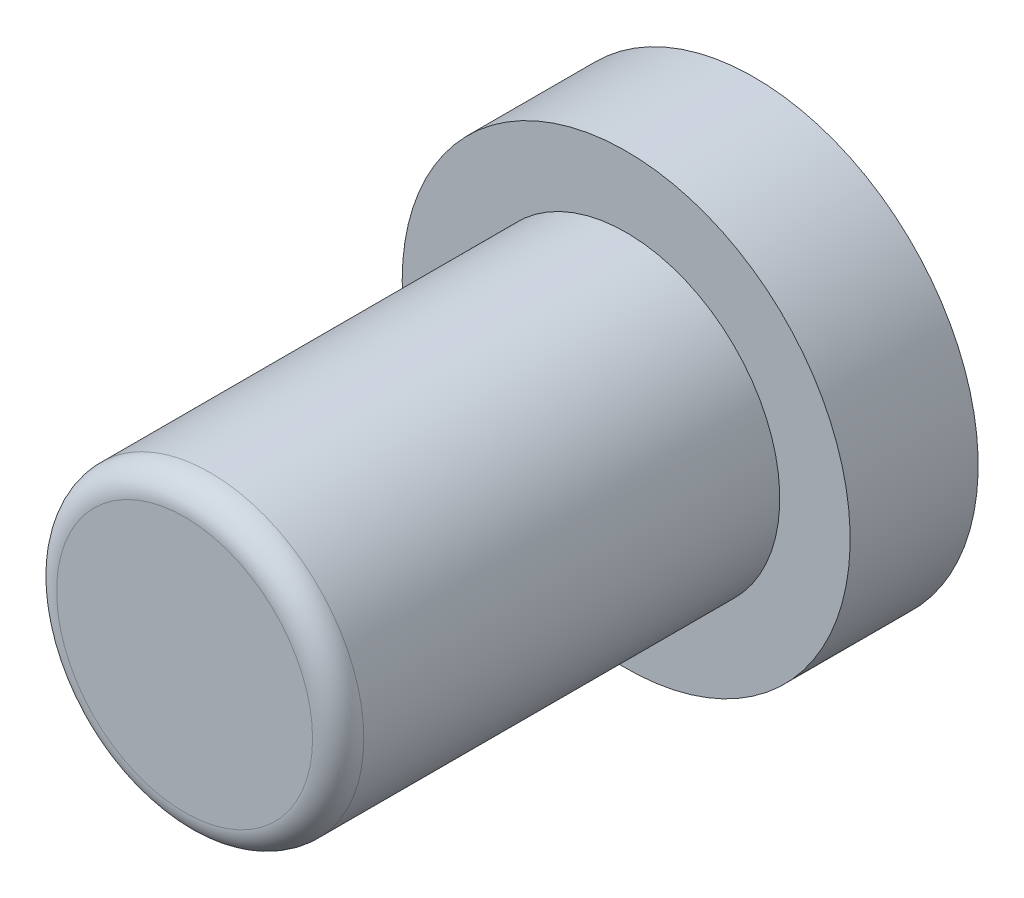
ISO-10303-21;
HEADER;
FILE_DESCRIPTION(('STEP AP214'),'2;1');
FILE_NAME('part.step','',(''),(''),'','','');
FILE_SCHEMA(('AUTOMOTIVE_DESIGN { 1 0 10303 214 1 1 1 1 }'));
ENDSEC;
DATA;
#1=APPLICATION_CONTEXT('core data for automotive mechanical design processes');
#2=APPLICATION_PROTOCOL_DEFINITION('international standard','automotive_design',2000,#1);
#3=PRODUCT_CONTEXT('',#1,'mechanical');
#4=PRODUCT('Part','Part','',(#3));
#5=PRODUCT_RELATED_PRODUCT_CATEGORY('part','',(#4));
#6=PRODUCT_DEFINITION_FORMATION('','',#4);
#7=PRODUCT_DEFINITION_CONTEXT('part definition',#1,'design');
#8=PRODUCT_DEFINITION('design','',#6,#7);
#9=PRODUCT_DEFINITION_SHAPE('','',#8);
#10=(LENGTH_UNIT() NAMED_UNIT(*) SI_UNIT(.MILLI.,.METRE.));
#11=(NAMED_UNIT(*) PLANE_ANGLE_UNIT() SI_UNIT($,.RADIAN.));
#12=(NAMED_UNIT(*) SI_UNIT($,.STERADIAN.) SOLID_ANGLE_UNIT());
#13=UNCERTAINTY_MEASURE_WITH_UNIT(LENGTH_MEASURE(1.E-05),#10,'distance_accuracy_value','');
#14=(GEOMETRIC_REPRESENTATION_CONTEXT(3) GLOBAL_UNCERTAINTY_ASSIGNED_CONTEXT((#13)) GLOBAL_UNIT_ASSIGNED_CONTEXT((#10,
#11,#12)) REPRESENTATION_CONTEXT('',''));
#15=CARTESIAN_POINT('',(0.,0.,0.));
#16=DIRECTION('',(0.,0.,1.));
#17=DIRECTION('',(1.,0.,0.));
#18=AXIS2_PLACEMENT_3D('',#15,#16,#17);
#19=CARTESIAN_POINT('',(0.,0.,8.9));
#20=DIRECTION('',(0.,0.,-1.));
#21=DIRECTION('',(-1.,0.,0.));
#22=AXIS2_PLACEMENT_3D('',#19,#20,#21);
#23=CYLINDRICAL_SURFACE('',#22,4.8);
#24=CARTESIAN_POINT('',(0.,0.,8.1));
#25=DIRECTION('',(0.,0.,1.));
#26=DIRECTION('',(1.,0.,0.));
#27=AXIS2_PLACEMENT_3D('',#24,#25,#26);
#28=CIRCLE('',#27,4.8);
#29=CARTESIAN_POINT('',(4.8,0.,8.1));
#30=VERTEX_POINT('',#29);
#31=EDGE_CURVE('E41',#30,#30,#28,.F.);
#32=ORIENTED_EDGE('',*,*,#31,.T.);
#33=EDGE_LOOP('',(#32));
#34=FACE_BOUND('',#33,.T.);
#35=CARTESIAN_POINT('',(0.,0.,-4.9));
#36=DIRECTION('',(0.,0.,-1.));
#37=DIRECTION('',(-1.,0.,0.));
#38=AXIS2_PLACEMENT_3D('',#35,#36,#37);
#39=CIRCLE('',#38,4.8);
#40=CARTESIAN_POINT('',(-4.8,0.,-4.9));
#41=VERTEX_POINT('',#40);
#42=EDGE_CURVE('E10',#41,#41,#39,.T.);
#43=ORIENTED_EDGE('',*,*,#42,.F.);
#44=EDGE_LOOP('',(#43));
#45=FACE_BOUND('',#44,.T.);
#46=ADVANCED_FACE('F34',(#34,#45),#23,.T.);
#47=CARTESIAN_POINT('',(0.,0.,8.9));
#48=DIRECTION('',(0.,0.,1.));
#49=DIRECTION('',(1.,0.,0.));
#50=AXIS2_PLACEMENT_3D('',#47,#48,#49);
#51=PLANE('',#50);
#52=CARTESIAN_POINT('',(0.,0.,8.9));
#53=DIRECTION('',(0.,0.,1.));
#54=DIRECTION('',(1.,0.,0.));
#55=AXIS2_PLACEMENT_3D('',#52,#53,#54);
#56=CIRCLE('',#55,4.);
#57=CARTESIAN_POINT('',(4.,0.,8.9));
#58=VERTEX_POINT('',#57);
#59=EDGE_CURVE('E45',#58,#58,#56,.T.);
#60=ORIENTED_EDGE('',*,*,#59,.T.);
#61=EDGE_LOOP('',(#60));
#62=FACE_BOUND('',#61,.T.);
#63=ADVANCED_FACE('F73',(#62),#51,.T.);
#64=CARTESIAN_POINT('',(0.,0.,8.1));
#65=DIRECTION('',(0.,0.,1.));
#66=DIRECTION('',(1.,0.,0.));
#67=AXIS2_PLACEMENT_3D('',#64,#65,#66);
#68=TOROIDAL_SURFACE('',#67,4.,0.8);
#69=ORIENTED_EDGE('',*,*,#31,.F.);
#70=EDGE_LOOP('',(#69));
#71=FACE_BOUND('',#70,.T.);
#72=ORIENTED_EDGE('',*,*,#59,.F.);
#73=EDGE_LOOP('',(#72));
#74=FACE_BOUND('',#73,.T.);
#75=ADVANCED_FACE('F36',(#71,#74),#68,.T.);
#76=CARTESIAN_POINT('',(0.,0.,-4.9));
#77=DIRECTION('',(0.,0.,-1.));
#78=DIRECTION('',(-1.,0.,0.));
#79=AXIS2_PLACEMENT_3D('',#76,#77,#78);
#80=CYLINDRICAL_SURFACE('',#79,7.);
#81=CARTESIAN_POINT('',(0.,0.,-4.9));
#82=DIRECTION('',(0.,0.,-1.));
#83=DIRECTION('',(-1.,0.,0.));
#84=AXIS2_PLACEMENT_3D('',#81,#82,#83);
#85=CIRCLE('',#84,7.);
#86=CARTESIAN_POINT('',(-7.,0.,-4.9));
#87=VERTEX_POINT('',#86);
#88=EDGE_CURVE('E49',#87,#87,#85,.T.);
#89=ORIENTED_EDGE('',*,*,#88,.T.);
#90=EDGE_LOOP('',(#89));
#91=FACE_BOUND('',#90,.T.);
#92=CARTESIAN_POINT('',(0.,0.,-8.9));
#93=DIRECTION('',(0.,0.,-1.));
#94=DIRECTION('',(-1.,0.,0.));
#95=AXIS2_PLACEMENT_3D('',#92,#93,#94);
#96=CIRCLE('',#95,7.);
#97=CARTESIAN_POINT('',(-7.,0.,-8.9));
#98=VERTEX_POINT('',#97);
#99=EDGE_CURVE('E52',#98,#98,#96,.T.);
#100=ORIENTED_EDGE('',*,*,#99,.F.);
#101=EDGE_LOOP('',(#100));
#102=FACE_BOUND('',#101,.T.);
#103=ADVANCED_FACE('F58',(#91,#102),#80,.T.);
#104=CARTESIAN_POINT('',(0.,0.,-4.9));
#105=DIRECTION('',(0.,0.,-1.));
#106=DIRECTION('',(-1.,0.,0.));
#107=AXIS2_PLACEMENT_3D('',#104,#105,#106);
#108=PLANE('',#107);
#109=ORIENTED_EDGE('',*,*,#42,.T.);
#110=EDGE_LOOP('',(#109));
#111=FACE_BOUND('',#110,.T.);
#112=ORIENTED_EDGE('',*,*,#88,.F.);
#113=EDGE_LOOP('',(#112));
#114=FACE_BOUND('',#113,.T.);
#115=ADVANCED_FACE('F61',(#111,#114),#108,.F.);
#116=CARTESIAN_POINT('',(0.,0.,-8.9));
#117=DIRECTION('',(0.,0.,1.));
#118=DIRECTION('',(1.,0.,0.));
#119=AXIS2_PLACEMENT_3D('',#116,#117,#118);
#120=PLANE('',#119);
#121=ORIENTED_EDGE('',*,*,#99,.T.);
#122=EDGE_LOOP('',(#121));
#123=FACE_BOUND('',#122,.T.);
#124=ADVANCED_FACE('F63',(#123),#120,.F.);
#125=CLOSED_SHELL('',(#46,#63,#75,#103,#115,#124));
#126=MANIFOLD_SOLID_BREP('B2',#125);
#127=ADVANCED_BREP_SHAPE_REPRESENTATION('',(#18,#126),#14);
#128=SHAPE_DEFINITION_REPRESENTATION(#9,#127);
ENDSEC;
END-ISO-10303-21;
